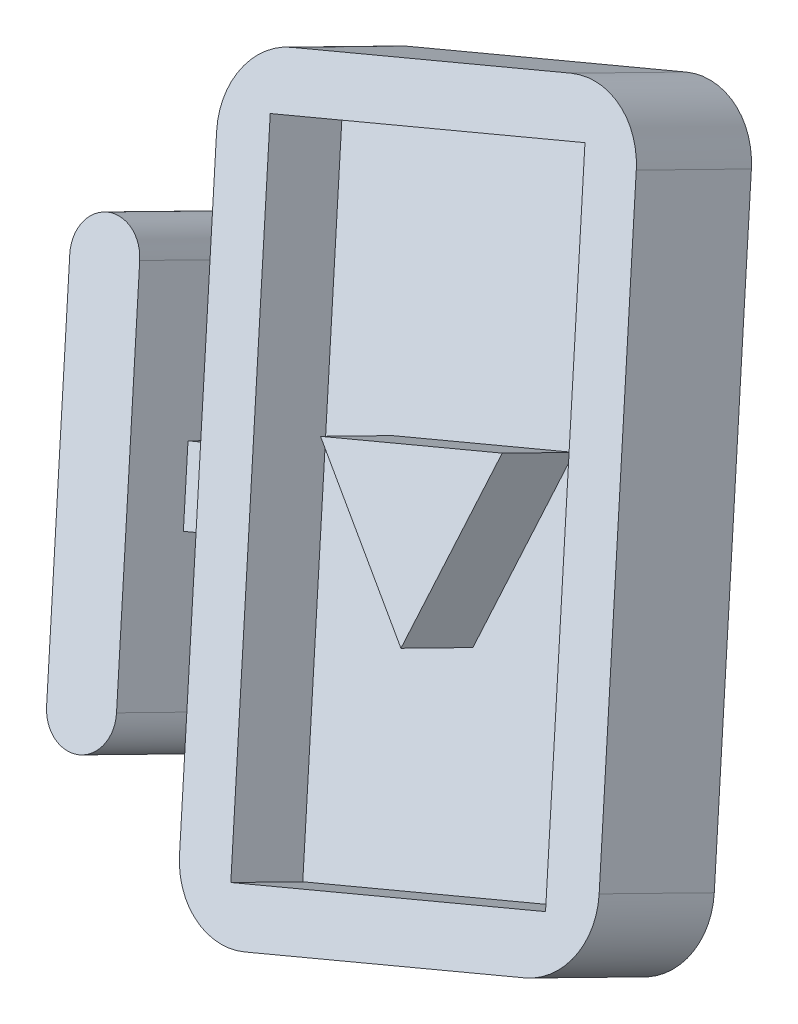
ISO-10303-21;
HEADER;
FILE_DESCRIPTION(('STEP AP214'),'2;1');
FILE_NAME('part.step','',(''),(''),'','','');
FILE_SCHEMA(('AUTOMOTIVE_DESIGN { 1 0 10303 214 1 1 1 1 }'));
ENDSEC;
DATA;
#1=APPLICATION_CONTEXT('core data for automotive mechanical design processes');
#2=APPLICATION_PROTOCOL_DEFINITION('international standard','automotive_design',2000,#1);
#3=PRODUCT_CONTEXT('',#1,'mechanical');
#4=PRODUCT('Part','Part','',(#3));
#5=PRODUCT_RELATED_PRODUCT_CATEGORY('part','',(#4));
#6=PRODUCT_DEFINITION_FORMATION('','',#4);
#7=PRODUCT_DEFINITION_CONTEXT('part definition',#1,'design');
#8=PRODUCT_DEFINITION('design','',#6,#7);
#9=PRODUCT_DEFINITION_SHAPE('','',#8);
#10=(LENGTH_UNIT() NAMED_UNIT(*) SI_UNIT(.MILLI.,.METRE.));
#11=(NAMED_UNIT(*) PLANE_ANGLE_UNIT() SI_UNIT($,.RADIAN.));
#12=(NAMED_UNIT(*) SI_UNIT($,.STERADIAN.) SOLID_ANGLE_UNIT());
#13=UNCERTAINTY_MEASURE_WITH_UNIT(LENGTH_MEASURE(1.E-05),#10,'distance_accuracy_value','');
#14=(GEOMETRIC_REPRESENTATION_CONTEXT(3) GLOBAL_UNCERTAINTY_ASSIGNED_CONTEXT((#13)) GLOBAL_UNIT_ASSIGNED_CONTEXT((#10,
#11,#12)) REPRESENTATION_CONTEXT('',''));
#15=CARTESIAN_POINT('',(0.,0.,0.));
#16=DIRECTION('',(0.,0.,1.));
#17=DIRECTION('',(1.,0.,0.));
#18=AXIS2_PLACEMENT_3D('',#15,#16,#17);
#19=CARTESIAN_POINT('',(-93.1106908216038,393.512194356411,69.3129772004135));
#20=DIRECTION('',(0.,0.440928700990653,0.897542133073816));
#21=DIRECTION('',(-0.939692620785905,-0.306977488994742,0.150806497509229));
#22=AXIS2_PLACEMENT_3D('',#19,#20,#21);
#23=PLANE('',#22);
#24=CARTESIAN_POINT('',(27.2833143082601,529.885011669704,2.3181398856949));
#25=DIRECTION('',(0.,0.440928700990653,0.897542133073816));
#26=DIRECTION('',(-0.939692620785905,-0.306977488994742,0.150806497509229));
#27=AXIS2_PLACEMENT_3D('',#24,#25,#26);
#28=CIRCLE('',#27,25.4);
#29=CARTESIAN_POINT('',(18.5960026677879,551.307720139769,-8.20603125829134));
#30=VERTEX_POINT('',#29);
#31=CARTESIAN_POINT('',(51.1515068762221,537.682239890171,-1.51234515103948));
#32=VERTEX_POINT('',#31);
#33=EDGE_CURVE('E284',#30,#32,#28,.F.);
#34=ORIENTED_EDGE('',*,*,#33,.T.);
#35=DIRECTION('',(0.342020143325679,-0.843413719293905,0.414337446613631));
#36=VECTOR('',#35,1.);
#37=CARTESIAN_POINT('',(85.9007534381111,451.99140600991,40.5843394249055));
#38=LINE('',#37,#36);
#39=CARTESIAN_POINT('',(120.65,366.300572129649,82.6810240008505));
#40=VERTEX_POINT('',#39);
#41=EDGE_CURVE('E203',#32,#40,#38,.T.);
#42=ORIENTED_EDGE('',*,*,#41,.T.);
#43=CARTESIAN_POINT('',(96.781807432038,358.503343909183,86.5115090375848));
#44=DIRECTION('',(0.,0.440928700990653,0.897542133073816));
#45=DIRECTION('',(-0.939692620785905,-0.306977488994742,0.150806497509229));
#46=AXIS2_PLACEMENT_3D('',#43,#44,#45);
#47=CIRCLE('',#46,25.4);
#48=CARTESIAN_POINT('',(105.46911907251,337.080635439117,97.0356801815712));
#49=VERTEX_POINT('',#48);
#50=EDGE_CURVE('E198',#40,#49,#47,.F.);
#51=ORIENTED_EDGE('',*,*,#50,.T.);
#52=DIRECTION('',(-0.939692620785905,-0.306977488994742,0.150806497509229));
#53=VECTOR('',#52,1.);
#54=CARTESIAN_POINT('',(-49.6741326192426,286.398652006086,121.933832920345));
#55=LINE('',#54,#53);
#56=CARTESIAN_POINT('',(9.99634880066169,305.891722557251,112.357620328509));
#57=VERTEX_POINT('',#56);
#58=EDGE_CURVE('E201',#49,#57,#55,.T.);
#59=ORIENTED_EDGE('',*,*,#58,.T.);
#60=CARTESIAN_POINT('',(1.30903716019012,327.314431027317,101.833449184522));
#61=DIRECTION('',(0.,0.440928700990653,0.897542133073816));
#62=DIRECTION('',(-0.939692620785905,-0.306977488994742,0.150806497509229));
#63=AXIS2_PLACEMENT_3D('',#60,#61,#62);
#64=CIRCLE('',#63,25.4);
#65=CARTESIAN_POINT('',(-22.5591554077719,319.51720280685,105.663934221257));
#66=VERTEX_POINT('',#65);
#67=EDGE_CURVE('E217',#57,#66,#64,.F.);
#68=ORIENTED_EDGE('',*,*,#67,.T.);
#69=DIRECTION('',(0.342020143325679,-0.843413719293905,0.414337446613631));
#70=VECTOR('',#69,1.);
#71=CARTESIAN_POINT('',(-57.3084019696609,405.208036687111,63.5672496453119));
#72=LINE('',#71,#70);
#73=CARTESIAN_POINT('',(-52.9647461494247,394.496682452079,68.8293352173052));
#74=VERTEX_POINT('',#73);
#75=EDGE_CURVE('E253',#74,#66,#72,.T.);
#76=ORIENTED_EDGE('',*,*,#75,.F.);
#77=DIRECTION('',(0.939692620785905,0.306977488994742,-0.150806497509229));
#78=VECTOR('',#77,1.);
#79=CARTESIAN_POINT('',(-88.7670350013677,382.800840121379,74.5750627724066));
#80=LINE('',#79,#78);
#81=CARTESIAN_POINT('',(-76.8329387173867,386.699454231612,72.6598202540396));
#82=VERTEX_POINT('',#81);
#83=EDGE_CURVE('E256',#82,#74,#80,.T.);
#84=ORIENTED_EDGE('',*,*,#83,.F.);
#85=DIRECTION('',(0.342020143325679,-0.843413719293905,0.414337446613631));
#86=VECTOR('',#85,1.);
#87=CARTESIAN_POINT('',(-81.1765945376228,397.410808466645,67.3977346820463));
#88=LINE('',#87,#86);
#89=CARTESIAN_POINT('',(-59.4583154364421,343.854037291482,93.7081625420121));
#90=VERTEX_POINT('',#89);
#91=EDGE_CURVE('E273',#82,#90,#88,.T.);
#92=ORIENTED_EDGE('',*,*,#91,.T.);
#93=CARTESIAN_POINT('',(-71.3924117204232,339.955423181248,95.6234050603791));
#94=DIRECTION('',(0.,0.440928700990653,0.897542133073816));
#95=DIRECTION('',(-0.939692620785905,-0.306977488994742,0.150806497509229));
#96=AXIS2_PLACEMENT_3D('',#93,#94,#95);
#97=CIRCLE('',#96,12.7);
#98=CARTESIAN_POINT('',(-83.3265080044042,336.056809071015,97.5386475787465));
#99=VERTEX_POINT('',#98);
#100=EDGE_CURVE('E247',#99,#90,#97,.T.);
#101=ORIENTED_EDGE('',*,*,#100,.F.);
#102=DIRECTION('',(0.342020143325679,-0.843413719293905,0.414337446613631));
#103=VECTOR('',#102,1.);
#104=CARTESIAN_POINT('',(-105.044787105585,389.613580246178,71.2282197187807));
#105=LINE('',#104,#103);
#106=CARTESIAN_POINT('',(-126.763066206765,443.170351421341,44.9177918588151));
#107=VERTEX_POINT('',#106);
#108=EDGE_CURVE('E242',#107,#99,#105,.T.);
#109=ORIENTED_EDGE('',*,*,#108,.F.);
#110=CARTESIAN_POINT('',(-114.828969922784,447.068965531574,43.0025493404479));
#111=DIRECTION('',(0.,0.440928700990653,0.897542133073816));
#112=DIRECTION('',(-0.939692620785905,-0.306977488994742,0.150806497509229));
#113=AXIS2_PLACEMENT_3D('',#110,#111,#112);
#114=CIRCLE('',#113,12.7);
#115=CARTESIAN_POINT('',(-102.894873638804,450.967579641808,41.0873068220807));
#116=VERTEX_POINT('',#115);
#117=EDGE_CURVE('E243',#116,#107,#114,.T.);
#118=ORIENTED_EDGE('',*,*,#117,.F.);
#119=CARTESIAN_POINT('',(-85.520250357859,408.122162701677,62.1356491100533));
#120=VERTEX_POINT('',#119);
#121=EDGE_CURVE('E270',#116,#120,#88,.T.);
#122=ORIENTED_EDGE('',*,*,#121,.T.);
#123=DIRECTION('',(0.939692620785905,0.306977488994742,-0.150806497509229));
#124=VECTOR('',#123,1.);
#125=CARTESIAN_POINT('',(-97.45434664184,404.223548591444,64.0508916284204));
#126=LINE('',#125,#124);
#127=CARTESIAN_POINT('',(-61.652057789897,415.919390922144,58.3051640733189));
#128=VERTEX_POINT('',#127);
#129=EDGE_CURVE('E272',#120,#128,#126,.T.);
#130=ORIENTED_EDGE('',*,*,#129,.T.);
#131=CARTESIAN_POINT('',(-92.0576485315499,490.898870567372,21.470565069367));
#132=VERTEX_POINT('',#131);
#133=EDGE_CURVE('E261',#132,#128,#72,.T.);
#134=ORIENTED_EDGE('',*,*,#133,.F.);
#135=CARTESIAN_POINT('',(-68.1894559635879,498.696098787838,17.6400800326325));
#136=DIRECTION('',(0.,0.440928700990653,0.897542133073816));
#137=DIRECTION('',(-0.939692620785905,-0.306977488994742,0.150806497509229));
#138=AXIS2_PLACEMENT_3D('',#135,#136,#137);
#139=CIRCLE('',#138,25.4);
#140=CARTESIAN_POINT('',(-76.8767676040601,520.118807257904,7.1159088886463));
#141=VERTEX_POINT('',#140);
#142=EDGE_CURVE('E276',#132,#141,#139,.F.);
#143=ORIENTED_EDGE('',*,*,#142,.T.);
#144=DIRECTION('',(-0.939692620785905,-0.306977488994742,0.150806497509229));
#145=VECTOR('',#144,1.);
#146=CARTESIAN_POINT('',(-136.547249023965,500.625736706737,16.6921214804823));
#147=LINE('',#146,#145);
#148=EDGE_CURVE('E279',#30,#141,#147,.T.);
#149=ORIENTED_EDGE('',*,*,#148,.F.);
#150=EDGE_LOOP('',(#34,#42,#51,#59,#68,#76,#84,#92,#101,#109,#118,#122,#130,#134,#143,#149));
#151=FACE_BOUND('',#150,.T.);
#152=ADVANCED_FACE('F43',(#151),#23,.F.);
#153=CARTESIAN_POINT('',(-97.45434664184,426.622726601769,109.64603198857));
#154=DIRECTION('',(-0.342020143325679,0.843413719293905,-0.414337446613631));
#155=DIRECTION('',(-0.939692620785905,-0.306977488994742,0.150806497509229));
#156=AXIS2_PLACEMENT_3D('',#153,#154,#155);
#157=PLANE('',#156);
#158=DIRECTION('',(0.,-0.440928700990653,-0.897542133073816));
#159=VECTOR('',#158,1.);
#160=CARTESIAN_POINT('',(-85.520250357859,430.521340712002,107.730789470203));
#161=LINE('',#160,#159);
#162=CARTESIAN_POINT('',(-85.520250357859,419.32175170684,84.9332192901281));
#163=VERTEX_POINT('',#162);
#164=EDGE_CURVE('E234',#163,#120,#161,.T.);
#165=ORIENTED_EDGE('',*,*,#164,.F.);
#166=DIRECTION('',(-0.939692620785905,-0.306977488994742,0.150806497509229));
#167=VECTOR('',#166,1.);
#168=CARTESIAN_POINT('',(-61.652057789897,427.118979927306,81.1027342533937));
#169=LINE('',#168,#167);
#170=CARTESIAN_POINT('',(-61.652057789897,427.118979927306,81.1027342533937));
#171=VERTEX_POINT('',#170);
#172=EDGE_CURVE('E306',#171,#163,#169,.T.);
#173=ORIENTED_EDGE('',*,*,#172,.F.);
#174=DIRECTION('',(0.,-0.440928700990653,-0.897542133073816));
#175=VECTOR('',#174,1.);
#176=CARTESIAN_POINT('',(-61.652057789897,438.318568932469,103.900304433469));
#177=LINE('',#176,#175);
#178=EDGE_CURVE('E230',#171,#128,#177,.T.);
#179=ORIENTED_EDGE('',*,*,#178,.T.);
#180=ORIENTED_EDGE('',*,*,#129,.F.);
#181=EDGE_LOOP('',(#165,#173,#179,#180));
#182=FACE_BOUND('',#181,.T.);
#183=ADVANCED_FACE('F365',(#182),#157,.T.);
#184=CARTESIAN_POINT('',(-88.7670350013677,405.200018131704,120.170203132556));
#185=DIRECTION('',(-0.342020143325679,0.843413719293905,-0.414337446613631));
#186=DIRECTION('',(-0.939692620785905,-0.306977488994742,0.150806497509229));
#187=AXIS2_PLACEMENT_3D('',#184,#185,#186);
#188=PLANE('',#187);
#189=DIRECTION('',(0.939692620785905,0.306977488994742,-0.150806497509229));
#190=VECTOR('',#189,1.);
#191=CARTESIAN_POINT('',(-52.9647461494247,405.696271457241,91.6269053973799));
#192=LINE('',#191,#190);
#193=CARTESIAN_POINT('',(-76.8329387173867,397.899043236775,95.4573904341143));
#194=VERTEX_POINT('',#193);
#195=CARTESIAN_POINT('',(-52.9647461494247,405.696271457241,91.6269053973799));
#196=VERTEX_POINT('',#195);
#197=EDGE_CURVE('E325',#194,#196,#192,.T.);
#198=ORIENTED_EDGE('',*,*,#197,.F.);
#199=DIRECTION('',(0.,-0.440928700990653,-0.897542133073816));
#200=VECTOR('',#199,1.);
#201=CARTESIAN_POINT('',(-76.8329387173867,409.098632241937,118.254960614189));
#202=LINE('',#201,#200);
#203=EDGE_CURVE('E233',#194,#82,#202,.T.);
#204=ORIENTED_EDGE('',*,*,#203,.T.);
#205=ORIENTED_EDGE('',*,*,#83,.T.);
#206=DIRECTION('',(0.,-0.440928700990653,-0.897542133073816));
#207=VECTOR('',#206,1.);
#208=CARTESIAN_POINT('',(-52.9647461494247,416.895860462404,114.424475577455));
#209=LINE('',#208,#207);
#210=EDGE_CURVE('E257',#196,#74,#209,.T.);
#211=ORIENTED_EDGE('',*,*,#210,.F.);
#212=EDGE_LOOP('',(#198,#204,#205,#211));
#213=FACE_BOUND('',#212,.T.);
#214=ADVANCED_FACE('F355',(#213),#188,.F.);
#215=CARTESIAN_POINT('',(-93.1106908216038,415.911372366737,114.908117560563));
#216=DIRECTION('',(0.,0.440928700990653,0.897542133073816));
#217=DIRECTION('',(-0.939692620785905,-0.306977488994742,0.150806497509229));
#218=AXIS2_PLACEMENT_3D('',#215,#216,#217);
#219=PLANE('',#218);
#220=CARTESIAN_POINT('',(-68.1894559635879,521.095276798164,63.2352203927824));
#221=DIRECTION('',(0.,0.440928700990653,0.897542133073816));
#222=DIRECTION('',(-0.939692620785905,-0.306977488994742,0.150806497509229));
#223=AXIS2_PLACEMENT_3D('',#220,#221,#222);
#224=CIRCLE('',#223,25.4);
#225=CARTESIAN_POINT('',(-76.8767676040601,542.517985268229,52.7110492487961));
#226=VERTEX_POINT('',#225);
#227=CARTESIAN_POINT('',(-92.0576485315499,513.298048577697,67.0657054295168));
#228=VERTEX_POINT('',#227);
#229=EDGE_CURVE('E264',#226,#228,#224,.T.);
#230=ORIENTED_EDGE('',*,*,#229,.T.);
#231=DIRECTION('',(0.342020143325679,-0.843413719293905,0.414337446613631));
#232=VECTOR('',#231,1.);
#233=CARTESIAN_POINT('',(-57.3084019696609,427.607214697436,109.162390005462));
#234=LINE('',#233,#232);
#235=CARTESIAN_POINT('',(-22.5591554077719,341.916380817176,151.259074581407));
#236=VERTEX_POINT('',#235);
#237=EDGE_CURVE('E292',#228,#236,#234,.T.);
#238=ORIENTED_EDGE('',*,*,#237,.T.);
#239=CARTESIAN_POINT('',(1.30903716019012,349.713609037642,147.428589544672));
#240=DIRECTION('',(0.,0.440928700990653,0.897542133073816));
#241=DIRECTION('',(-0.939692620785905,-0.306977488994742,0.150806497509229));
#242=AXIS2_PLACEMENT_3D('',#239,#240,#241);
#243=CIRCLE('',#242,25.4);
#244=CARTESIAN_POINT('',(9.99634880066237,328.290900567577,157.952760688659));
#245=VERTEX_POINT('',#244);
#246=EDGE_CURVE('E295',#236,#245,#243,.T.);
#247=ORIENTED_EDGE('',*,*,#246,.T.);
#248=DIRECTION('',(-0.939692620785905,-0.306977488994742,0.150806497509229));
#249=VECTOR('',#248,1.);
#250=CARTESIAN_POINT('',(-49.6741326192426,308.797830016411,167.528973280495));
#251=LINE('',#250,#249);
#252=CARTESIAN_POINT('',(105.46911907251,359.479813449443,142.630820541721));
#253=VERTEX_POINT('',#252);
#254=EDGE_CURVE('E227',#253,#245,#251,.T.);
#255=ORIENTED_EDGE('',*,*,#254,.F.);
#256=CARTESIAN_POINT('',(96.781807432038,380.902521919508,132.106649397735));
#257=DIRECTION('',(0.,0.440928700990653,0.897542133073816));
#258=DIRECTION('',(-0.939692620785905,-0.306977488994742,0.150806497509229));
#259=AXIS2_PLACEMENT_3D('',#256,#257,#258);
#260=CIRCLE('',#259,25.4);
#261=CARTESIAN_POINT('',(120.65,388.699750139974,128.276164361));
#262=VERTEX_POINT('',#261);
#263=EDGE_CURVE('E222',#253,#262,#260,.T.);
#264=ORIENTED_EDGE('',*,*,#263,.T.);
#265=DIRECTION('',(0.342020143325679,-0.843413719293905,0.414337446613631));
#266=VECTOR('',#265,1.);
#267=CARTESIAN_POINT('',(85.9007534381111,474.390584020235,86.1794797850553));
#268=LINE('',#267,#266);
#269=CARTESIAN_POINT('',(51.1515068762221,560.081417900496,44.0827952091104));
#270=VERTEX_POINT('',#269);
#271=EDGE_CURVE('E225',#270,#262,#268,.T.);
#272=ORIENTED_EDGE('',*,*,#271,.F.);
#273=CARTESIAN_POINT('',(27.2833143082601,552.284189680029,47.9132802458447));
#274=DIRECTION('',(0.,0.440928700990653,0.897542133073816));
#275=DIRECTION('',(-0.939692620785905,-0.306977488994742,0.150806497509229));
#276=AXIS2_PLACEMENT_3D('',#273,#274,#275);
#277=CIRCLE('',#276,25.4);
#278=CARTESIAN_POINT('',(18.5960026677879,573.706898150095,37.3891091018585));
#279=VERTEX_POINT('',#278);
#280=EDGE_CURVE('E299',#270,#279,#277,.T.);
#281=ORIENTED_EDGE('',*,*,#280,.T.);
#282=DIRECTION('',(-0.939692620785905,-0.306977488994742,0.150806497509229));
#283=VECTOR('',#282,1.);
#284=CARTESIAN_POINT('',(-136.547249023965,523.024914717063,62.2872618406322));
#285=LINE('',#284,#283);
#286=EDGE_CURVE('E296',#279,#226,#285,.T.);
#287=ORIENTED_EDGE('',*,*,#286,.T.);
#288=EDGE_LOOP('',(#230,#238,#247,#255,#264,#272,#281,#287));
#289=FACE_BOUND('',#288,.T.);
#290=DIRECTION('',(0.939692620785905,0.306977488994742,-0.150806497509229));
#291=VECTOR('',#290,1.);
#292=CARTESIAN_POINT('',(-2.48618307168241,342.408624865009,151.017253589852));
#293=LINE('',#292,#291);
#294=CARTESIAN_POINT('',(-2.48618307168241,342.408624865009,151.017253589852));
#295=VERTEX_POINT('',#294);
#296=CARTESIAN_POINT('',(104.920683484147,377.496151857108,133.780070924548));
#297=VERTEX_POINT('',#296);
#298=EDGE_CURVE('E208',#295,#297,#293,.T.);
#299=ORIENTED_EDGE('',*,*,#298,.F.);
#300=DIRECTION('',(0.342020143325679,-0.843413719293905,0.414337446613631));
#301=VECTOR('',#300,1.);
#302=CARTESIAN_POINT('',(-76.3283320156966,524.501646860563,61.5617988659695));
#303=LINE('',#302,#301);
#304=CARTESIAN_POINT('',(-76.3283320156966,524.501646860563,61.5617988659695));
#305=VERTEX_POINT('',#304);
#306=EDGE_CURVE('E313',#305,#295,#303,.T.);
#307=ORIENTED_EDGE('',*,*,#306,.F.);
#308=DIRECTION('',(-0.939692620785905,-0.306977488994742,0.150806497509229));
#309=VECTOR('',#308,1.);
#310=CARTESIAN_POINT('',(-76.3283320156966,524.501646860563,61.5617988659695));
#311=LINE('',#310,#309);
#312=CARTESIAN_POINT('',(31.0785345401325,559.589173852662,44.3246162006646));
#313=VERTEX_POINT('',#312);
#314=EDGE_CURVE('E310',#313,#305,#311,.T.);
#315=ORIENTED_EDGE('',*,*,#314,.F.);
#316=DIRECTION('',(-0.342020143325679,0.843413719293905,-0.414337446613631));
#317=VECTOR('',#316,1.);
#318=CARTESIAN_POINT('',(31.0785345401325,559.589173852662,44.3246162006646));
#319=LINE('',#318,#317);
#320=EDGE_CURVE('E307',#297,#313,#319,.T.);
#321=ORIENTED_EDGE('',*,*,#320,.F.);
#322=EDGE_LOOP('',(#299,#307,#315,#321));
#323=FACE_BOUND('',#322,.T.);
#324=ADVANCED_FACE('F353',(#289,#323),#219,.T.);
#325=CARTESIAN_POINT('',(-49.6741326192426,308.797830016411,167.528973280495));
#326=DIRECTION('',(0.342020143325679,-0.843413719293905,0.414337446613631));
#327=DIRECTION('',(0.939692620785905,0.306977488994742,-0.150806497509229));
#328=AXIS2_PLACEMENT_3D('',#325,#326,#327);
#329=PLANE('',#328);
#330=ORIENTED_EDGE('',*,*,#254,.T.);
#331=DIRECTION('',(0.,-0.440928700990653,-0.897542133073816));
#332=VECTOR('',#331,1.);
#333=CARTESIAN_POINT('',(9.99634880066238,305.891722557252,112.357620328509));
#334=LINE('',#333,#332);
#335=EDGE_CURVE('E216',#245,#57,#334,.T.);
#336=ORIENTED_EDGE('',*,*,#335,.T.);
#337=ORIENTED_EDGE('',*,*,#58,.F.);
#338=DIRECTION('',(0.,-0.440928700990653,-0.897542133073816));
#339=VECTOR('',#338,1.);
#340=CARTESIAN_POINT('',(105.46911907251,359.479813449443,142.630820541721));
#341=LINE('',#340,#339);
#342=EDGE_CURVE('E213',#49,#253,#341,.F.);
#343=ORIENTED_EDGE('',*,*,#342,.T.);
#344=EDGE_LOOP('',(#330,#336,#337,#343));
#345=FACE_BOUND('',#344,.T.);
#346=ADVANCED_FACE('F212',(#345),#329,.T.);
#347=CARTESIAN_POINT('',(85.9007534381111,474.390584020235,86.1794797850553));
#348=DIRECTION('',(0.939692620785905,0.306977488994742,-0.150806497509228));
#349=DIRECTION('',(-0.342020143325679,0.843413719293905,-0.414337446613631));
#350=AXIS2_PLACEMENT_3D('',#347,#348,#349);
#351=PLANE('',#350);
#352=ORIENTED_EDGE('',*,*,#41,.F.);
#353=DIRECTION('',(0.,-0.440928700990653,-0.897542133073816));
#354=VECTOR('',#353,1.);
#355=CARTESIAN_POINT('',(51.1515068762221,560.081417900496,44.0827952091104));
#356=LINE('',#355,#354);
#357=EDGE_CURVE('E223',#32,#270,#356,.F.);
#358=ORIENTED_EDGE('',*,*,#357,.T.);
#359=ORIENTED_EDGE('',*,*,#271,.T.);
#360=DIRECTION('',(0.,-0.440928700990653,-0.897542133073816));
#361=VECTOR('',#360,1.);
#362=CARTESIAN_POINT('',(120.65,388.699750139974,128.276164361));
#363=LINE('',#362,#361);
#364=EDGE_CURVE('E283',#262,#40,#363,.T.);
#365=ORIENTED_EDGE('',*,*,#364,.T.);
#366=EDGE_LOOP('',(#352,#358,#359,#365));
#367=FACE_BOUND('',#366,.T.);
#368=ADVANCED_FACE('F363',(#367),#351,.T.);
#369=CARTESIAN_POINT('',(-136.547249023965,523.024914717063,62.2872618406322));
#370=DIRECTION('',(0.342020143325679,-0.843413719293905,0.414337446613631));
#371=DIRECTION('',(0.939692620785905,0.306977488994742,-0.150806497509229));
#372=AXIS2_PLACEMENT_3D('',#369,#370,#371);
#373=PLANE('',#372);
#374=ORIENTED_EDGE('',*,*,#148,.T.);
#375=DIRECTION('',(0.,-0.440928700990653,-0.897542133073816));
#376=VECTOR('',#375,1.);
#377=CARTESIAN_POINT('',(-76.8767676040601,542.517985268229,52.7110492487961));
#378=LINE('',#377,#376);
#379=EDGE_CURVE('E282',#141,#226,#378,.F.);
#380=ORIENTED_EDGE('',*,*,#379,.T.);
#381=ORIENTED_EDGE('',*,*,#286,.F.);
#382=DIRECTION('',(0.,-0.440928700990653,-0.897542133073816));
#383=VECTOR('',#382,1.);
#384=CARTESIAN_POINT('',(18.5960026677879,551.307720139769,-8.20603125829134));
#385=LINE('',#384,#383);
#386=EDGE_CURVE('E269',#279,#30,#385,.T.);
#387=ORIENTED_EDGE('',*,*,#386,.T.);
#388=EDGE_LOOP('',(#374,#380,#381,#387));
#389=FACE_BOUND('',#388,.T.);
#390=ADVANCED_FACE('F399',(#389),#373,.F.);
#391=CARTESIAN_POINT('',(-114.828969922784,469.4681435419,88.5976897005978));
#392=DIRECTION('',(0.,-0.440928700990653,-0.897542133073816));
#393=DIRECTION('',(0.939692620785905,0.306977488994742,-0.150806497509229));
#394=AXIS2_PLACEMENT_3D('',#391,#392,#393);
#395=CYLINDRICAL_SURFACE('',#394,12.7);
#396=ORIENTED_EDGE('',*,*,#117,.T.);
#397=DIRECTION('',(0.,-0.440928700990653,-0.897542133073816));
#398=VECTOR('',#397,1.);
#399=CARTESIAN_POINT('',(-126.763066206765,465.569529431666,90.5129322189649));
#400=LINE('',#399,#398);
#401=CARTESIAN_POINT('',(-126.763066206765,465.569529431666,90.5129322189649));
#402=VERTEX_POINT('',#401);
#403=EDGE_CURVE('E244',#402,#107,#400,.T.);
#404=ORIENTED_EDGE('',*,*,#403,.F.);
#405=CARTESIAN_POINT('',(-114.828969922784,469.4681435419,88.5976897005978));
#406=DIRECTION('',(0.,0.440928700990653,0.897542133073816));
#407=DIRECTION('',(-0.939692620785905,-0.306977488994742,0.150806497509229));
#408=AXIS2_PLACEMENT_3D('',#405,#406,#407);
#409=CIRCLE('',#408,12.7);
#410=CARTESIAN_POINT('',(-102.894873638803,473.366757652133,86.6824471822306));
#411=VERTEX_POINT('',#410);
#412=EDGE_CURVE('E288',#411,#402,#409,.T.);
#413=ORIENTED_EDGE('',*,*,#412,.F.);
#414=DIRECTION('',(0.,-0.440928700990653,-0.897542133073816));
#415=VECTOR('',#414,1.);
#416=CARTESIAN_POINT('',(-102.894873638803,473.366757652133,86.6824471822306));
#417=LINE('',#416,#415);
#418=EDGE_CURVE('E239',#411,#116,#417,.T.);
#419=ORIENTED_EDGE('',*,*,#418,.T.);
#420=EDGE_LOOP('',(#396,#404,#413,#419));
#421=FACE_BOUND('',#420,.T.);
#422=ADVANCED_FACE('F396',(#421),#395,.T.);
#423=CARTESIAN_POINT('',(-105.044787105585,412.012758256503,116.823360078931));
#424=DIRECTION('',(0.939692620785905,0.306977488994743,-0.150806497509229));
#425=DIRECTION('',(-0.342020143325679,0.843413719293905,-0.414337446613631));
#426=AXIS2_PLACEMENT_3D('',#423,#424,#425);
#427=PLANE('',#426);
#428=ORIENTED_EDGE('',*,*,#108,.T.);
#429=DIRECTION('',(0.,-0.440928700990653,-0.897542133073816));
#430=VECTOR('',#429,1.);
#431=CARTESIAN_POINT('',(-83.3265080044042,358.45598708134,143.133787938896));
#432=LINE('',#431,#430);
#433=CARTESIAN_POINT('',(-83.3265080044042,358.45598708134,143.133787938896));
#434=VERTEX_POINT('',#433);
#435=EDGE_CURVE('E238',#434,#99,#432,.T.);
#436=ORIENTED_EDGE('',*,*,#435,.F.);
#437=DIRECTION('',(0.342020143325679,-0.843413719293905,0.414337446613631));
#438=VECTOR('',#437,1.);
#439=CARTESIAN_POINT('',(-105.044787105585,412.012758256503,116.823360078931));
#440=LINE('',#439,#438);
#441=EDGE_CURVE('E218',#402,#434,#440,.T.);
#442=ORIENTED_EDGE('',*,*,#441,.F.);
#443=ORIENTED_EDGE('',*,*,#403,.T.);
#444=EDGE_LOOP('',(#428,#436,#442,#443));
#445=FACE_BOUND('',#444,.T.);
#446=ADVANCED_FACE('F392',(#445),#427,.F.);
#447=CARTESIAN_POINT('',(-71.3924117204232,362.354601191574,141.218545420529));
#448=DIRECTION('',(0.,-0.440928700990653,-0.897542133073816));
#449=DIRECTION('',(0.939692620785905,0.306977488994742,-0.150806497509229));
#450=AXIS2_PLACEMENT_3D('',#447,#448,#449);
#451=CYLINDRICAL_SURFACE('',#450,12.7);
#452=ORIENTED_EDGE('',*,*,#100,.T.);
#453=DIRECTION('',(0.,-0.440928700990653,-0.897542133073816));
#454=VECTOR('',#453,1.);
#455=CARTESIAN_POINT('',(-59.4583154364422,366.253215301807,139.303302902162));
#456=LINE('',#455,#454);
#457=CARTESIAN_POINT('',(-59.4583154364422,366.253215301807,139.303302902162));
#458=VERTEX_POINT('',#457);
#459=EDGE_CURVE('E250',#458,#90,#456,.T.);
#460=ORIENTED_EDGE('',*,*,#459,.F.);
#461=CARTESIAN_POINT('',(-71.3924117204232,362.354601191574,141.218545420529));
#462=DIRECTION('',(0.,0.440928700990653,0.897542133073816));
#463=DIRECTION('',(-0.939692620785905,-0.306977488994742,0.150806497509229));
#464=AXIS2_PLACEMENT_3D('',#461,#462,#463);
#465=CIRCLE('',#464,12.7);
#466=EDGE_CURVE('E260',#434,#458,#465,.T.);
#467=ORIENTED_EDGE('',*,*,#466,.F.);
#468=ORIENTED_EDGE('',*,*,#435,.T.);
#469=EDGE_LOOP('',(#452,#460,#467,#468));
#470=FACE_BOUND('',#469,.T.);
#471=ADVANCED_FACE('F388',(#470),#451,.T.);
#472=CARTESIAN_POINT('',(-81.1765945376228,419.80998647697,112.992875042196));
#473=DIRECTION('',(0.939692620785905,0.306977488994743,-0.150806497509229));
#474=DIRECTION('',(-0.342020143325679,0.843413719293905,-0.414337446613631));
#475=AXIS2_PLACEMENT_3D('',#472,#473,#474);
#476=PLANE('',#475);
#477=ORIENTED_EDGE('',*,*,#91,.F.);
#478=ORIENTED_EDGE('',*,*,#203,.F.);
#479=DIRECTION('',(0.342020143325679,-0.843413719293905,0.414337446613631));
#480=VECTOR('',#479,1.);
#481=CARTESIAN_POINT('',(-85.520250357859,419.32175170684,84.9332192901281));
#482=LINE('',#481,#480);
#483=EDGE_CURVE('E327',#163,#194,#482,.T.);
#484=ORIENTED_EDGE('',*,*,#483,.F.);
#485=ORIENTED_EDGE('',*,*,#164,.T.);
#486=ORIENTED_EDGE('',*,*,#121,.F.);
#487=ORIENTED_EDGE('',*,*,#418,.F.);
#488=DIRECTION('',(0.342020143325679,-0.843413719293905,0.414337446613631));
#489=VECTOR('',#488,1.);
#490=CARTESIAN_POINT('',(-81.1765945376228,419.80998647697,112.992875042196));
#491=LINE('',#490,#489);
#492=EDGE_CURVE('E237',#411,#458,#491,.T.);
#493=ORIENTED_EDGE('',*,*,#492,.T.);
#494=ORIENTED_EDGE('',*,*,#459,.T.);
#495=EDGE_LOOP('',(#477,#478,#484,#485,#486,#487,#493,#494));
#496=FACE_BOUND('',#495,.T.);
#497=ADVANCED_FACE('F383',(#496),#476,.T.);
#498=CARTESIAN_POINT('',(-57.3084019696609,427.607214697436,109.162390005462));
#499=DIRECTION('',(0.939692620785905,0.306977488994742,-0.150806497509229));
#500=DIRECTION('',(-0.342020143325679,0.843413719293905,-0.414337446613631));
#501=AXIS2_PLACEMENT_3D('',#498,#499,#500);
#502=PLANE('',#501);
#503=ORIENTED_EDGE('',*,*,#75,.T.);
#504=DIRECTION('',(0.,-0.440928700990653,-0.897542133073816));
#505=VECTOR('',#504,1.);
#506=CARTESIAN_POINT('',(-22.5591554077719,341.916380817176,151.259074581407));
#507=LINE('',#506,#505);
#508=EDGE_CURVE('E468',#66,#236,#507,.F.);
#509=ORIENTED_EDGE('',*,*,#508,.T.);
#510=ORIENTED_EDGE('',*,*,#237,.F.);
#511=DIRECTION('',(0.,-0.440928700990653,-0.897542133073816));
#512=VECTOR('',#511,1.);
#513=CARTESIAN_POINT('',(-92.0576485315499,513.298048577697,67.0657054295168));
#514=LINE('',#513,#512);
#515=EDGE_CURVE('E278',#228,#132,#514,.T.);
#516=ORIENTED_EDGE('',*,*,#515,.T.);
#517=ORIENTED_EDGE('',*,*,#133,.T.);
#518=ORIENTED_EDGE('',*,*,#178,.F.);
#519=DIRECTION('',(-0.342020143325679,0.843413719293905,-0.414337446613631));
#520=VECTOR('',#519,1.);
#521=CARTESIAN_POINT('',(-61.652057789897,427.118979927306,81.1027342533937));
#522=LINE('',#521,#520);
#523=EDGE_CURVE('E323',#196,#171,#522,.T.);
#524=ORIENTED_EDGE('',*,*,#523,.F.);
#525=ORIENTED_EDGE('',*,*,#210,.T.);
#526=EDGE_LOOP('',(#503,#509,#510,#516,#517,#518,#524,#525));
#527=FACE_BOUND('',#526,.T.);
#528=ADVANCED_FACE('F373',(#527),#502,.F.);
#529=ORIENTED_EDGE('',*,*,#466,.T.);
#530=ORIENTED_EDGE('',*,*,#492,.F.);
#531=ORIENTED_EDGE('',*,*,#412,.T.);
#532=ORIENTED_EDGE('',*,*,#441,.T.);
#533=EDGE_LOOP('',(#529,#530,#531,#532));
#534=FACE_BOUND('',#533,.T.);
#535=ADVANCED_FACE('F358',(#534),#219,.T.);
#536=CARTESIAN_POINT('',(1.30903716019012,349.713609037642,147.428589544672));
#537=DIRECTION('',(0.,0.440928700990653,0.897542133073816));
#538=DIRECTION('',(-0.939692620785905,-0.306977488994742,0.150806497509229));
#539=AXIS2_PLACEMENT_3D('',#536,#537,#538);
#540=CYLINDRICAL_SURFACE('',#539,25.4);
#541=ORIENTED_EDGE('',*,*,#246,.F.);
#542=ORIENTED_EDGE('',*,*,#508,.F.);
#543=ORIENTED_EDGE('',*,*,#67,.F.);
#544=ORIENTED_EDGE('',*,*,#335,.F.);
#545=EDGE_LOOP('',(#541,#542,#543,#544));
#546=FACE_BOUND('',#545,.T.);
#547=ADVANCED_FACE('F372',(#546),#540,.T.);
#548=CARTESIAN_POINT('',(-68.1894559635879,521.095276798164,63.2352203927824));
#549=DIRECTION('',(0.,-0.440928700990653,-0.897542133073816));
#550=DIRECTION('',(0.939692620785905,0.306977488994742,-0.150806497509229));
#551=AXIS2_PLACEMENT_3D('',#548,#549,#550);
#552=CYLINDRICAL_SURFACE('',#551,25.4);
#553=ORIENTED_EDGE('',*,*,#229,.F.);
#554=ORIENTED_EDGE('',*,*,#379,.F.);
#555=ORIENTED_EDGE('',*,*,#142,.F.);
#556=ORIENTED_EDGE('',*,*,#515,.F.);
#557=EDGE_LOOP('',(#553,#554,#555,#556));
#558=FACE_BOUND('',#557,.T.);
#559=ADVANCED_FACE('F410',(#558),#552,.T.);
#560=CARTESIAN_POINT('',(27.2833143082601,552.284189680029,47.9132802458447));
#561=DIRECTION('',(0.,0.440928700990653,0.897542133073816));
#562=DIRECTION('',(-0.939692620785905,-0.306977488994742,0.150806497509229));
#563=AXIS2_PLACEMENT_3D('',#560,#561,#562);
#564=CYLINDRICAL_SURFACE('',#563,25.4);
#565=ORIENTED_EDGE('',*,*,#280,.F.);
#566=ORIENTED_EDGE('',*,*,#357,.F.);
#567=ORIENTED_EDGE('',*,*,#33,.F.);
#568=ORIENTED_EDGE('',*,*,#386,.F.);
#569=EDGE_LOOP('',(#565,#566,#567,#568));
#570=FACE_BOUND('',#569,.T.);
#571=ADVANCED_FACE('F414',(#570),#564,.T.);
#572=CARTESIAN_POINT('',(96.781807432038,380.902521919508,132.106649397735));
#573=DIRECTION('',(0.,-0.440928700990653,-0.897542133073816));
#574=DIRECTION('',(0.939692620785905,0.306977488994742,-0.150806497509229));
#575=AXIS2_PLACEMENT_3D('',#572,#573,#574);
#576=CYLINDRICAL_SURFACE('',#575,25.4);
#577=ORIENTED_EDGE('',*,*,#263,.F.);
#578=ORIENTED_EDGE('',*,*,#342,.F.);
#579=ORIENTED_EDGE('',*,*,#50,.F.);
#580=ORIENTED_EDGE('',*,*,#364,.F.);
#581=EDGE_LOOP('',(#577,#578,#579,#580));
#582=FACE_BOUND('',#581,.T.);
#583=ADVANCED_FACE('F221',(#582),#576,.T.);
#584=CARTESIAN_POINT('',(-2.48618307168241,339.608727613718,145.317861044834));
#585=DIRECTION('',(0.342020143325679,-0.843413719293905,0.414337446613631));
#586=DIRECTION('',(0.939692620785905,0.306977488994742,-0.150806497509229));
#587=AXIS2_PLACEMENT_3D('',#584,#585,#586);
#588=PLANE('',#587);
#589=ORIENTED_EDGE('',*,*,#298,.T.);
#590=DIRECTION('',(0.,0.440928700990653,0.897542133073816));
#591=VECTOR('',#590,1.);
#592=CARTESIAN_POINT('',(104.920683484147,374.696254605818,128.080678379529));
#593=LINE('',#592,#591);
#594=CARTESIAN_POINT('',(104.920683484147,363.496665600655,105.283108199454));
#595=VERTEX_POINT('',#594);
#596=EDGE_CURVE('E303',#595,#297,#593,.T.);
#597=ORIENTED_EDGE('',*,*,#596,.F.);
#598=DIRECTION('',(0.939692620785905,0.306977488994742,-0.150806497509229));
#599=VECTOR('',#598,1.);
#600=CARTESIAN_POINT('',(-2.48618307168241,328.409138608556,122.520290864759));
#601=LINE('',#600,#599);
#602=CARTESIAN_POINT('',(-2.48618307168241,328.409138608556,122.520290864759));
#603=VERTEX_POINT('',#602);
#604=EDGE_CURVE('E332',#603,#595,#601,.T.);
#605=ORIENTED_EDGE('',*,*,#604,.F.);
#606=DIRECTION('',(0.,0.440928700990653,0.897542133073816));
#607=VECTOR('',#606,1.);
#608=CARTESIAN_POINT('',(-2.48618307168241,339.608727613718,145.317861044834));
#609=LINE('',#608,#607);
#610=EDGE_CURVE('E314',#603,#295,#609,.T.);
#611=ORIENTED_EDGE('',*,*,#610,.T.);
#612=EDGE_LOOP('',(#589,#597,#605,#611));
#613=FACE_BOUND('',#612,.T.);
#614=ADVANCED_FACE('F344',(#613),#588,.F.);
#615=CARTESIAN_POINT('',(-76.3283320156966,521.701749609272,55.8624063209507));
#616=DIRECTION('',(-0.939692620785905,-0.306977488994742,0.150806497509229));
#617=DIRECTION('',(0.342020143325679,-0.843413719293905,0.414337446613631));
#618=AXIS2_PLACEMENT_3D('',#615,#616,#617);
#619=PLANE('',#618);
#620=ORIENTED_EDGE('',*,*,#306,.T.);
#621=ORIENTED_EDGE('',*,*,#610,.F.);
#622=DIRECTION('',(0.342020143325679,-0.843413719293905,0.414337446613631));
#623=VECTOR('',#622,1.);
#624=CARTESIAN_POINT('',(-76.3283320156966,510.50216060411,33.0648361408758));
#625=LINE('',#624,#623);
#626=CARTESIAN_POINT('',(-76.3283320156966,510.50216060411,33.0648361408758));
#627=VERTEX_POINT('',#626);
#628=EDGE_CURVE('E47',#627,#603,#625,.T.);
#629=ORIENTED_EDGE('',*,*,#628,.F.);
#630=DIRECTION('',(0.,0.440928700990653,0.897542133073816));
#631=VECTOR('',#630,1.);
#632=CARTESIAN_POINT('',(-76.3283320156966,521.701749609272,55.8624063209507));
#633=LINE('',#632,#631);
#634=EDGE_CURVE('E311',#627,#305,#633,.T.);
#635=ORIENTED_EDGE('',*,*,#634,.T.);
#636=EDGE_LOOP('',(#620,#621,#629,#635));
#637=FACE_BOUND('',#636,.T.);
#638=ADVANCED_FACE('F340',(#637),#619,.F.);
#639=CARTESIAN_POINT('',(-76.3283320156966,521.701749609272,55.8624063209507));
#640=DIRECTION('',(-0.342020143325679,0.843413719293905,-0.414337446613631));
#641=DIRECTION('',(-0.939692620785905,-0.306977488994742,0.150806497509229));
#642=AXIS2_PLACEMENT_3D('',#639,#640,#641);
#643=PLANE('',#642);
#644=ORIENTED_EDGE('',*,*,#314,.T.);
#645=ORIENTED_EDGE('',*,*,#634,.F.);
#646=DIRECTION('',(-0.939692620785905,-0.306977488994742,0.150806497509229));
#647=VECTOR('',#646,1.);
#648=CARTESIAN_POINT('',(31.0785345401325,545.589687596209,15.8276534755709));
#649=LINE('',#648,#647);
#650=CARTESIAN_POINT('',(31.0785345401325,545.589687596209,15.8276534755709));
#651=VERTEX_POINT('',#650);
#652=EDGE_CURVE('E12',#651,#627,#649,.T.);
#653=ORIENTED_EDGE('',*,*,#652,.F.);
#654=DIRECTION('',(0.,0.440928700990653,0.897542133073816));
#655=VECTOR('',#654,1.);
#656=CARTESIAN_POINT('',(31.0785345401325,556.789276601372,38.6252236556458));
#657=LINE('',#656,#655);
#658=EDGE_CURVE('E308',#651,#313,#657,.T.);
#659=ORIENTED_EDGE('',*,*,#658,.T.);
#660=EDGE_LOOP('',(#644,#645,#653,#659));
#661=FACE_BOUND('',#660,.T.);
#662=ADVANCED_FACE('F350',(#661),#643,.F.);
#663=CARTESIAN_POINT('',(31.0785345401325,556.789276601372,38.6252236556458));
#664=DIRECTION('',(0.939692620785905,0.306977488994742,-0.150806497509229));
#665=DIRECTION('',(-0.342020143325679,0.843413719293905,-0.414337446613631));
#666=AXIS2_PLACEMENT_3D('',#663,#664,#665);
#667=PLANE('',#666);
#668=ORIENTED_EDGE('',*,*,#320,.T.);
#669=ORIENTED_EDGE('',*,*,#658,.F.);
#670=DIRECTION('',(-0.342020143325679,0.843413719293905,-0.414337446613631));
#671=VECTOR('',#670,1.);
#672=CARTESIAN_POINT('',(104.920683484147,363.496665600655,105.283108199454));
#673=LINE('',#672,#671);
#674=EDGE_CURVE('E52',#595,#651,#673,.T.);
#675=ORIENTED_EDGE('',*,*,#674,.F.);
#676=ORIENTED_EDGE('',*,*,#596,.T.);
#677=EDGE_LOOP('',(#668,#669,#675,#676));
#678=FACE_BOUND('',#677,.T.);
#679=ADVANCED_FACE('F348',(#678),#667,.F.);
#680=CARTESIAN_POINT('',(-93.1106908216038,404.711783361574,92.1105473804884));
#681=DIRECTION('',(0.,0.440928700990653,0.897542133073816));
#682=DIRECTION('',(-0.939692620785905,-0.306977488994742,0.150806497509229));
#683=AXIS2_PLACEMENT_3D('',#680,#681,#682);
#684=PLANE('',#683);
#685=ORIENTED_EDGE('',*,*,#172,.T.);
#686=ORIENTED_EDGE('',*,*,#483,.T.);
#687=ORIENTED_EDGE('',*,*,#197,.T.);
#688=ORIENTED_EDGE('',*,*,#523,.T.);
#689=EDGE_LOOP('',(#685,#686,#687,#688));
#690=FACE_BOUND('',#689,.T.);
#691=ADVANCED_FACE('F509',(#690),#684,.T.);
#692=CARTESIAN_POINT('',(0.,112.336347895625,228.66872826702));
#693=DIRECTION('',(0.,0.440928700990653,0.897542133073816));
#694=DIRECTION('',(0.,-0.897542133073816,0.440928700990653));
#695=AXIS2_PLACEMENT_3D('',#692,#693,#694);
#696=PLANE('',#695);
#697=DIRECTION('',(-0.173648177666919,-0.883906451306211,0.434230003261198));
#698=VECTOR('',#697,1.);
#699=CARTESIAN_POINT('',(27.3271431949335,404.865350397285,84.9602288861441));
#700=LINE('',#699,#698);
#701=CARTESIAN_POINT('',(38.7863836632819,463.195341031975,56.3048977862328));
#702=VERTEX_POINT('',#701);
#703=CARTESIAN_POINT('',(27.3271431949335,404.865350397285,84.9602288861441));
#704=VERTEX_POINT('',#703);
#705=EDGE_CURVE('E60',#702,#704,#700,.T.);
#706=ORIENTED_EDGE('',*,*,#705,.T.);
#707=DIRECTION('',(-0.766044443118986,0.576928962311467,-0.283423505751969));
#708=VECTOR('',#707,1.);
#709=CARTESIAN_POINT('',(-23.2249996555401,442.937547877888,66.2567898381174));
#710=LINE('',#709,#708);
#711=CARTESIAN_POINT('',(-23.2249996555402,442.937547877888,66.2567898381174));
#712=VERTEX_POINT('',#711);
#713=EDGE_CURVE('E457',#704,#712,#710,.T.);
#714=ORIENTED_EDGE('',*,*,#713,.T.);
#715=DIRECTION('',(0.939692620785904,0.306977488994743,-0.150806497509229));
#716=VECTOR('',#715,1.);
#717=CARTESIAN_POINT('',(38.7863836632819,463.195341031975,56.3048977862328));
#718=LINE('',#717,#716);
#719=EDGE_CURVE('E64',#712,#702,#718,.T.);
#720=ORIENTED_EDGE('',*,*,#719,.T.);
#721=EDGE_LOOP('',(#706,#714,#720));
#722=FACE_BOUND('',#721,.T.);
#723=ORIENTED_EDGE('',*,*,#628,.T.);
#724=ORIENTED_EDGE('',*,*,#604,.T.);
#725=ORIENTED_EDGE('',*,*,#674,.T.);
#726=ORIENTED_EDGE('',*,*,#652,.T.);
#727=EDGE_LOOP('',(#723,#724,#725,#726));
#728=FACE_BOUND('',#727,.T.);
#729=ADVANCED_FACE('F45',(#722,#728),#696,.T.);
#730=CARTESIAN_POINT('',(27.3271431949335,365.257955838264,4.33652415082143));
#731=DIRECTION('',(0.98480775301221,-0.155856555787547,0.0765664654080688));
#732=DIRECTION('',(0.156315422908569,0.98770718766288,0.));
#733=AXIS2_PLACEMENT_3D('',#730,#731,#732);
#734=PLANE('',#733);
#735=DIRECTION('',(0.173648177666919,0.88390645130621,-0.434230003261198));
#736=VECTOR('',#735,1.);
#737=CARTESIAN_POINT('',(27.3271431949335,418.864836653738,113.457191611238));
#738=LINE('',#737,#736);
#739=CARTESIAN_POINT('',(27.3271431949335,418.864836653738,113.457191611238));
#740=VERTEX_POINT('',#739);
#741=CARTESIAN_POINT('',(38.7863836632819,477.194827288428,84.8018605113265));
#742=VERTEX_POINT('',#741);
#743=EDGE_CURVE('E442',#740,#742,#738,.T.);
#744=ORIENTED_EDGE('',*,*,#743,.F.);
#745=DIRECTION('',(0.,0.440928700990653,0.897542133073816));
#746=VECTOR('',#745,1.);
#747=CARTESIAN_POINT('',(27.3271431949335,365.257955838264,4.33652415082143));
#748=LINE('',#747,#746);
#749=EDGE_CURVE('E455',#704,#740,#748,.T.);
#750=ORIENTED_EDGE('',*,*,#749,.F.);
#751=ORIENTED_EDGE('',*,*,#705,.F.);
#752=DIRECTION('',(0.,0.440928700990653,0.897542133073816));
#753=VECTOR('',#752,1.);
#754=CARTESIAN_POINT('',(38.7863836632819,423.587946472954,-24.3188069490899));
#755=LINE('',#754,#753);
#756=EDGE_CURVE('E454',#702,#742,#755,.T.);
#757=ORIENTED_EDGE('',*,*,#756,.T.);
#758=EDGE_LOOP('',(#744,#750,#751,#757));
#759=FACE_BOUND('',#758,.T.);
#760=ADVANCED_FACE('F421',(#759),#734,.T.);
#761=CARTESIAN_POINT('',(-23.2249996555402,403.330153318867,-14.3669148972054));
#762=DIRECTION('',(-0.64278760968653,-0.687557163506358,0.337770981205563));
#763=DIRECTION('',(0.730489237848379,-0.682924207645104,0.));
#764=AXIS2_PLACEMENT_3D('',#761,#762,#763);
#765=PLANE('',#764);
#766=DIRECTION('',(0.766044443118986,-0.576928962311467,0.283423505751969));
#767=VECTOR('',#766,1.);
#768=CARTESIAN_POINT('',(-23.2249996555402,456.937034134341,94.753752563211));
#769=LINE('',#768,#767);
#770=CARTESIAN_POINT('',(-23.2249996555402,456.937034134341,94.753752563211));
#771=VERTEX_POINT('',#770);
#772=EDGE_CURVE('E446',#771,#740,#769,.T.);
#773=ORIENTED_EDGE('',*,*,#772,.F.);
#774=DIRECTION('',(0.,0.440928700990653,0.897542133073816));
#775=VECTOR('',#774,1.);
#776=CARTESIAN_POINT('',(-23.2249996555402,403.330153318867,-14.3669148972054));
#777=LINE('',#776,#775);
#778=EDGE_CURVE('E458',#712,#771,#777,.T.);
#779=ORIENTED_EDGE('',*,*,#778,.F.);
#780=ORIENTED_EDGE('',*,*,#713,.F.);
#781=ORIENTED_EDGE('',*,*,#749,.T.);
#782=EDGE_LOOP('',(#773,#779,#780,#781));
#783=FACE_BOUND('',#782,.T.);
#784=ADVANCED_FACE('F424',(#783),#765,.T.);
#785=CARTESIAN_POINT('',(38.7863836632819,423.587946472954,-24.3188069490899));
#786=DIRECTION('',(-0.34202014332568,0.843413719293905,-0.414337446613631));
#787=DIRECTION('',(0.,0.440928700990653,0.897542133073816));
#788=AXIS2_PLACEMENT_3D('',#785,#786,#787);
#789=PLANE('',#788);
#790=DIRECTION('',(-0.939692620785904,-0.306977488994743,0.150806497509229));
#791=VECTOR('',#790,1.);
#792=CARTESIAN_POINT('',(38.7863836632819,477.194827288428,84.8018605113265));
#793=LINE('',#792,#791);
#794=EDGE_CURVE('E444',#742,#771,#793,.T.);
#795=ORIENTED_EDGE('',*,*,#794,.F.);
#796=ORIENTED_EDGE('',*,*,#756,.F.);
#797=ORIENTED_EDGE('',*,*,#719,.F.);
#798=ORIENTED_EDGE('',*,*,#778,.T.);
#799=EDGE_LOOP('',(#795,#796,#797,#798));
#800=FACE_BOUND('',#799,.T.);
#801=ADVANCED_FACE('F426',(#800),#789,.T.);
#802=CARTESIAN_POINT('',(0.,126.335834152079,257.165690992114));
#803=DIRECTION('',(0.,0.440928700990654,0.897542133073816));
#804=DIRECTION('',(0.,-0.897542133073816,0.440928700990654));
#805=AXIS2_PLACEMENT_3D('',#802,#803,#804);
#806=PLANE('',#805);
#807=ORIENTED_EDGE('',*,*,#743,.T.);
#808=ORIENTED_EDGE('',*,*,#794,.T.);
#809=ORIENTED_EDGE('',*,*,#772,.T.);
#810=EDGE_LOOP('',(#807,#808,#809));
#811=FACE_BOUND('',#810,.T.);
#812=ADVANCED_FACE('F429',(#811),#806,.T.);
#813=CLOSED_SHELL('',(#152,#183,#214,#324,#346,#368,#390,#422,#446,#471,#497,#528,#535,#547,
#559,#571,#583,#614,#638,#662,#679,#691,#729,#760,#784,#801,#812));
#814=MANIFOLD_SOLID_BREP('B2',#813);
#815=ADVANCED_BREP_SHAPE_REPRESENTATION('',(#18,#814),#14);
#816=SHAPE_DEFINITION_REPRESENTATION(#9,#815);
ENDSEC;
END-ISO-10303-21;
